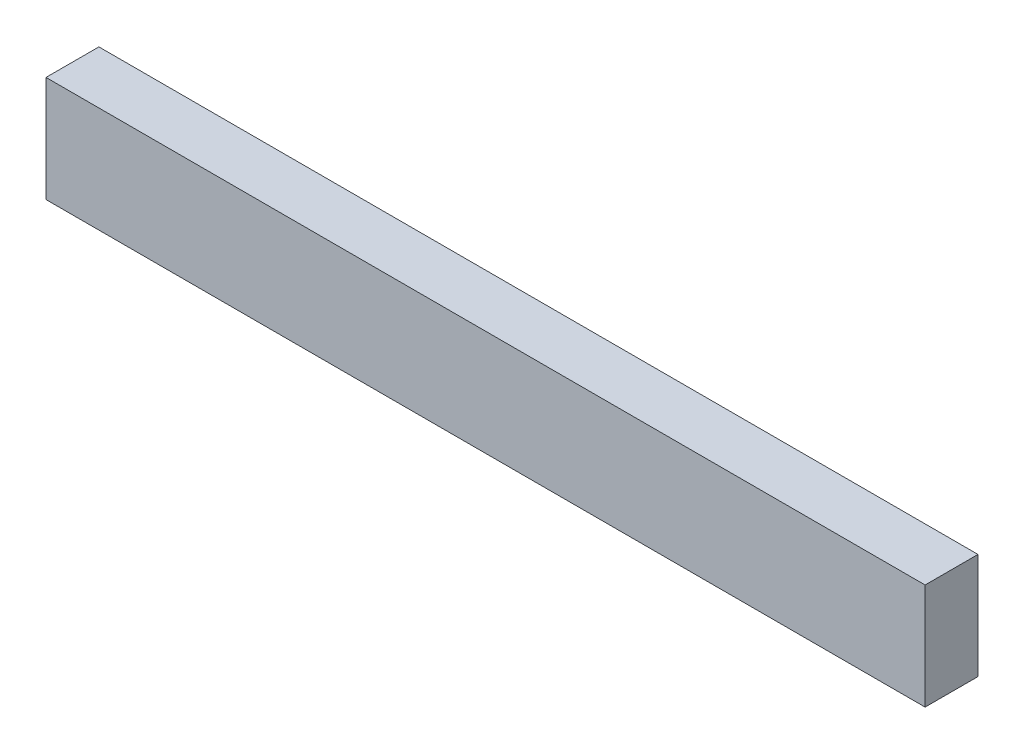
ISO-10303-21;
HEADER;
FILE_DESCRIPTION(('STEP AP214'),'2;1');
FILE_NAME('part.step','',(''),(''),'','','');
FILE_SCHEMA(('AUTOMOTIVE_DESIGN { 1 0 10303 214 1 1 1 1 }'));
ENDSEC;
DATA;
#1=APPLICATION_CONTEXT('core data for automotive mechanical design processes');
#2=APPLICATION_PROTOCOL_DEFINITION('international standard','automotive_design',2000,#1);
#3=PRODUCT_CONTEXT('',#1,'mechanical');
#4=PRODUCT('Part','Part','',(#3));
#5=PRODUCT_RELATED_PRODUCT_CATEGORY('part','',(#4));
#6=PRODUCT_DEFINITION_FORMATION('','',#4);
#7=PRODUCT_DEFINITION_CONTEXT('part definition',#1,'design');
#8=PRODUCT_DEFINITION('design','',#6,#7);
#9=PRODUCT_DEFINITION_SHAPE('','',#8);
#10=(LENGTH_UNIT() NAMED_UNIT(*) SI_UNIT(.MILLI.,.METRE.));
#11=(NAMED_UNIT(*) PLANE_ANGLE_UNIT() SI_UNIT($,.RADIAN.));
#12=(NAMED_UNIT(*) SI_UNIT($,.STERADIAN.) SOLID_ANGLE_UNIT());
#13=UNCERTAINTY_MEASURE_WITH_UNIT(LENGTH_MEASURE(1.E-05),#10,'distance_accuracy_value','');
#14=(GEOMETRIC_REPRESENTATION_CONTEXT(3) GLOBAL_UNCERTAINTY_ASSIGNED_CONTEXT((#13)) GLOBAL_UNIT_ASSIGNED_CONTEXT((#10,
#11,#12)) REPRESENTATION_CONTEXT('',''));
#15=CARTESIAN_POINT('',(0.,0.,0.));
#16=DIRECTION('',(0.,0.,1.));
#17=DIRECTION('',(1.,0.,0.));
#18=AXIS2_PLACEMENT_3D('',#15,#16,#17);
#19=CARTESIAN_POINT('',(-36.0789667552571,29.5758485138678,19.05));
#20=DIRECTION('',(1.,0.,0.));
#21=DIRECTION('',(0.,1.,0.));
#22=AXIS2_PLACEMENT_3D('',#19,#20,#21);
#23=PLANE('',#22);
#24=DIRECTION('',(0.,-1.,0.));
#25=VECTOR('',#24,1.);
#26=CARTESIAN_POINT('',(-36.0789667552571,29.5758485138678,0.));
#27=LINE('',#26,#25);
#28=CARTESIAN_POINT('',(-36.0789667552571,29.5758485138678,0.));
#29=VERTEX_POINT('',#28);
#30=CARTESIAN_POINT('',(-36.0789667552571,-8.52415148613218,0.));
#31=VERTEX_POINT('',#30);
#32=EDGE_CURVE('E107',#29,#31,#27,.T.);
#33=ORIENTED_EDGE('',*,*,#32,.T.);
#34=DIRECTION('',(0.,0.,-1.));
#35=VECTOR('',#34,1.);
#36=CARTESIAN_POINT('',(-36.0789667552571,-8.52415148613218,19.05));
#37=LINE('',#36,#35);
#38=CARTESIAN_POINT('',(-36.0789667552571,-8.52415148613218,19.05));
#39=VERTEX_POINT('',#38);
#40=EDGE_CURVE('E11',#39,#31,#37,.T.);
#41=ORIENTED_EDGE('',*,*,#40,.F.);
#42=DIRECTION('',(0.,-1.,0.));
#43=VECTOR('',#42,1.);
#44=CARTESIAN_POINT('',(-36.0789667552571,29.5758485138678,19.05));
#45=LINE('',#44,#43);
#46=CARTESIAN_POINT('',(-36.0789667552571,29.5758485138678,19.05));
#47=VERTEX_POINT('',#46);
#48=EDGE_CURVE('E91',#47,#39,#45,.T.);
#49=ORIENTED_EDGE('',*,*,#48,.F.);
#50=DIRECTION('',(0.,0.,-1.));
#51=VECTOR('',#50,1.);
#52=CARTESIAN_POINT('',(-36.0789667552571,29.5758485138678,19.05));
#53=LINE('',#52,#51);
#54=EDGE_CURVE('E103',#47,#29,#53,.T.);
#55=ORIENTED_EDGE('',*,*,#54,.T.);
#56=EDGE_LOOP('',(#33,#41,#49,#55));
#57=FACE_BOUND('',#56,.T.);
#58=ADVANCED_FACE('F39',(#57),#23,.F.);
#59=CARTESIAN_POINT('',(-36.0789667552571,-8.52415148613218,19.05));
#60=DIRECTION('',(0.,1.,0.));
#61=DIRECTION('',(0.,0.,1.));
#62=AXIS2_PLACEMENT_3D('',#59,#60,#61);
#63=PLANE('',#62);
#64=DIRECTION('',(1.,0.,0.));
#65=VECTOR('',#64,1.);
#66=CARTESIAN_POINT('',(-36.0789667552571,-8.52415148613218,0.));
#67=LINE('',#66,#65);
#68=CARTESIAN_POINT('',(280.506633244743,-8.52415148613218,0.));
#69=VERTEX_POINT('',#68);
#70=EDGE_CURVE('E96',#31,#69,#67,.T.);
#71=ORIENTED_EDGE('',*,*,#70,.T.);
#72=DIRECTION('',(0.,0.,-1.));
#73=VECTOR('',#72,1.);
#74=CARTESIAN_POINT('',(280.506633244743,-8.52415148613218,19.05));
#75=LINE('',#74,#73);
#76=CARTESIAN_POINT('',(280.506633244743,-8.52415148613218,19.05));
#77=VERTEX_POINT('',#76);
#78=EDGE_CURVE('E48',#77,#69,#75,.T.);
#79=ORIENTED_EDGE('',*,*,#78,.F.);
#80=DIRECTION('',(1.,0.,0.));
#81=VECTOR('',#80,1.);
#82=CARTESIAN_POINT('',(-36.0789667552571,-8.52415148613218,19.05));
#83=LINE('',#82,#81);
#84=EDGE_CURVE('E86',#39,#77,#83,.T.);
#85=ORIENTED_EDGE('',*,*,#84,.F.);
#86=ORIENTED_EDGE('',*,*,#40,.T.);
#87=EDGE_LOOP('',(#71,#79,#85,#86));
#88=FACE_BOUND('',#87,.T.);
#89=ADVANCED_FACE('F95',(#88),#63,.F.);
#90=CARTESIAN_POINT('',(280.506633244743,29.5758485138678,19.05));
#91=DIRECTION('',(-1.,0.,0.));
#92=DIRECTION('',(0.,0.,1.));
#93=AXIS2_PLACEMENT_3D('',#90,#91,#92);
#94=PLANE('',#93);
#95=DIRECTION('',(0.,1.,0.));
#96=VECTOR('',#95,1.);
#97=CARTESIAN_POINT('',(280.506633244743,29.5758485138678,0.));
#98=LINE('',#97,#96);
#99=CARTESIAN_POINT('',(280.506633244743,29.5758485138678,0.));
#100=VERTEX_POINT('',#99);
#101=EDGE_CURVE('E73',#69,#100,#98,.T.);
#102=ORIENTED_EDGE('',*,*,#101,.T.);
#103=DIRECTION('',(0.,0.,-1.));
#104=VECTOR('',#103,1.);
#105=CARTESIAN_POINT('',(280.506633244743,29.5758485138678,19.05));
#106=LINE('',#105,#104);
#107=CARTESIAN_POINT('',(280.506633244743,29.5758485138678,19.05));
#108=VERTEX_POINT('',#107);
#109=EDGE_CURVE('E98',#108,#100,#106,.T.);
#110=ORIENTED_EDGE('',*,*,#109,.F.);
#111=DIRECTION('',(0.,1.,0.));
#112=VECTOR('',#111,1.);
#113=CARTESIAN_POINT('',(280.506633244743,29.5758485138678,19.05));
#114=LINE('',#113,#112);
#115=EDGE_CURVE('E89',#77,#108,#114,.T.);
#116=ORIENTED_EDGE('',*,*,#115,.F.);
#117=ORIENTED_EDGE('',*,*,#78,.T.);
#118=EDGE_LOOP('',(#102,#110,#116,#117));
#119=FACE_BOUND('',#118,.T.);
#120=ADVANCED_FACE('F99',(#119),#94,.F.);
#121=CARTESIAN_POINT('',(-36.0789667552571,29.5758485138678,19.05));
#122=DIRECTION('',(0.,-1.,0.));
#123=DIRECTION('',(0.,0.,-1.));
#124=AXIS2_PLACEMENT_3D('',#121,#122,#123);
#125=PLANE('',#124);
#126=DIRECTION('',(-1.,0.,0.));
#127=VECTOR('',#126,1.);
#128=CARTESIAN_POINT('',(-36.0789667552571,29.5758485138678,0.));
#129=LINE('',#128,#127);
#130=EDGE_CURVE('E79',#100,#29,#129,.T.);
#131=ORIENTED_EDGE('',*,*,#130,.T.);
#132=ORIENTED_EDGE('',*,*,#54,.F.);
#133=DIRECTION('',(-1.,0.,0.));
#134=VECTOR('',#133,1.);
#135=CARTESIAN_POINT('',(-36.0789667552571,29.5758485138678,19.05));
#136=LINE('',#135,#134);
#137=EDGE_CURVE('E56',#108,#47,#136,.T.);
#138=ORIENTED_EDGE('',*,*,#137,.F.);
#139=ORIENTED_EDGE('',*,*,#109,.T.);
#140=EDGE_LOOP('',(#131,#132,#138,#139));
#141=FACE_BOUND('',#140,.T.);
#142=ADVANCED_FACE('F120',(#141),#125,.F.);
#143=CARTESIAN_POINT('',(0.,0.,19.05));
#144=DIRECTION('',(0.,0.,1.));
#145=DIRECTION('',(1.,0.,0.));
#146=AXIS2_PLACEMENT_3D('',#143,#144,#145);
#147=PLANE('',#146);
#148=ORIENTED_EDGE('',*,*,#48,.T.);
#149=ORIENTED_EDGE('',*,*,#84,.T.);
#150=ORIENTED_EDGE('',*,*,#115,.T.);
#151=ORIENTED_EDGE('',*,*,#137,.T.);
#152=EDGE_LOOP('',(#148,#149,#150,#151));
#153=FACE_BOUND('',#152,.T.);
#154=ADVANCED_FACE('F87',(#153),#147,.T.);
#155=CARTESIAN_POINT('',(0.,0.,0.));
#156=DIRECTION('',(0.,0.,1.));
#157=DIRECTION('',(1.,0.,0.));
#158=AXIS2_PLACEMENT_3D('',#155,#156,#157);
#159=PLANE('',#158);
#160=ORIENTED_EDGE('',*,*,#32,.F.);
#161=ORIENTED_EDGE('',*,*,#130,.F.);
#162=ORIENTED_EDGE('',*,*,#101,.F.);
#163=ORIENTED_EDGE('',*,*,#70,.F.);
#164=EDGE_LOOP('',(#160,#161,#162,#163));
#165=FACE_BOUND('',#164,.T.);
#166=ADVANCED_FACE('F123',(#165),#159,.F.);
#167=CLOSED_SHELL('',(#58,#89,#120,#142,#154,#166));
#168=MANIFOLD_SOLID_BREP('B2',#167);
#169=ADVANCED_BREP_SHAPE_REPRESENTATION('',(#18,#168),#14);
#170=SHAPE_DEFINITION_REPRESENTATION(#9,#169);
ENDSEC;
END-ISO-10303-21;
